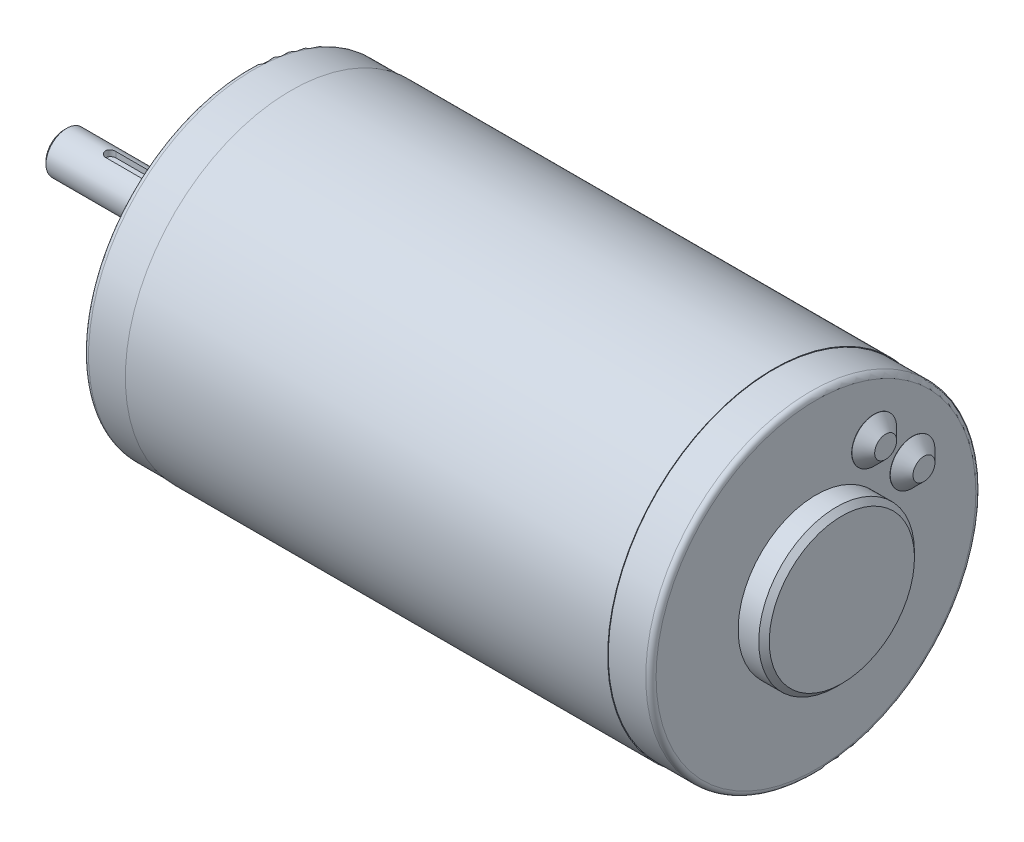
ISO-10303-21;
HEADER;
FILE_DESCRIPTION(('STEP AP214'),'2;1');
FILE_NAME('part.step','',(''),(''),'','','');
FILE_SCHEMA(('AUTOMOTIVE_DESIGN { 1 0 10303 214 1 1 1 1 }'));
ENDSEC;
DATA;
#1=APPLICATION_CONTEXT('core data for automotive mechanical design processes');
#2=APPLICATION_PROTOCOL_DEFINITION('international standard','automotive_design',2000,#1);
#3=PRODUCT_CONTEXT('',#1,'mechanical');
#4=PRODUCT('Part','Part','',(#3));
#5=PRODUCT_RELATED_PRODUCT_CATEGORY('part','',(#4));
#6=PRODUCT_DEFINITION_FORMATION('','',#4);
#7=PRODUCT_DEFINITION_CONTEXT('part definition',#1,'design');
#8=PRODUCT_DEFINITION('design','',#6,#7);
#9=PRODUCT_DEFINITION_SHAPE('','',#8);
#10=(LENGTH_UNIT() NAMED_UNIT(*) SI_UNIT(.MILLI.,.METRE.));
#11=(NAMED_UNIT(*) PLANE_ANGLE_UNIT() SI_UNIT($,.RADIAN.));
#12=(NAMED_UNIT(*) SI_UNIT($,.STERADIAN.) SOLID_ANGLE_UNIT());
#13=UNCERTAINTY_MEASURE_WITH_UNIT(LENGTH_MEASURE(1.E-05),#10,'distance_accuracy_value','');
#14=(GEOMETRIC_REPRESENTATION_CONTEXT(3) GLOBAL_UNCERTAINTY_ASSIGNED_CONTEXT((#13)) GLOBAL_UNIT_ASSIGNED_CONTEXT((#10,
#11,#12)) REPRESENTATION_CONTEXT('',''));
#15=CARTESIAN_POINT('',(0.,0.,0.));
#16=DIRECTION('',(0.,0.,1.));
#17=DIRECTION('',(1.,0.,0.));
#18=AXIS2_PLACEMENT_3D('',#15,#16,#17);
#19=CARTESIAN_POINT('',(-27.6,2.79999999999999,-1.));
#20=DIRECTION('',(0.,-1.,0.));
#21=DIRECTION('',(0.,0.,-1.));
#22=AXIS2_PLACEMENT_3D('',#19,#20,#21);
#23=PLANE('',#22);
#24=CARTESIAN_POINT('',(-7.1,2.79999999999999,0.));
#25=DIRECTION('',(0.,1.,0.));
#26=DIRECTION('',(0.,0.,1.));
#27=AXIS2_PLACEMENT_3D('',#24,#25,#26);
#28=CIRCLE('',#27,1.);
#29=CARTESIAN_POINT('',(-7.1,2.79999999999999,1.));
#30=VERTEX_POINT('',#29);
#31=CARTESIAN_POINT('',(-7.1,2.79999999999999,-1.));
#32=VERTEX_POINT('',#31);
#33=EDGE_CURVE('E80',#30,#32,#28,.T.);
#34=ORIENTED_EDGE('',*,*,#33,.T.);
#35=DIRECTION('',(1.,0.,0.));
#36=VECTOR('',#35,1.);
#37=CARTESIAN_POINT('',(-27.6,2.79999999999999,-1.));
#38=LINE('',#37,#36);
#39=CARTESIAN_POINT('',(-26.6,2.79999999999999,-1.));
#40=VERTEX_POINT('',#39);
#41=EDGE_CURVE('E75',#40,#32,#38,.T.);
#42=ORIENTED_EDGE('',*,*,#41,.F.);
#43=CARTESIAN_POINT('',(-26.6,2.79999999999999,0.));
#44=DIRECTION('',(0.,-1.,0.));
#45=DIRECTION('',(0.,0.,-1.));
#46=AXIS2_PLACEMENT_3D('',#43,#44,#45);
#47=CIRCLE('',#46,1.);
#48=CARTESIAN_POINT('',(-26.6,2.79999999999999,1.));
#49=VERTEX_POINT('',#48);
#50=EDGE_CURVE('E77',#40,#49,#47,.F.);
#51=ORIENTED_EDGE('',*,*,#50,.T.);
#52=DIRECTION('',(1.,0.,0.));
#53=VECTOR('',#52,1.);
#54=CARTESIAN_POINT('',(-27.6,2.79999999999999,1.));
#55=LINE('',#54,#53);
#56=EDGE_CURVE('E103',#49,#30,#55,.T.);
#57=ORIENTED_EDGE('',*,*,#56,.T.);
#58=EDGE_LOOP('',(#34,#42,#51,#57));
#59=FACE_BOUND('',#58,.T.);
#60=ADVANCED_FACE('F17',(#59),#23,.F.);
#61=CARTESIAN_POINT('',(-35.6,0.,0.));
#62=DIRECTION('',(-1.,0.,0.));
#63=DIRECTION('',(0.,0.,1.));
#64=AXIS2_PLACEMENT_3D('',#61,#62,#63);
#65=PLANE('',#64);
#66=CARTESIAN_POINT('',(-35.6000000000449,0.,0.));
#67=DIRECTION('',(1.,0.,0.));
#68=DIRECTION('',(0.,0.,-1.));
#69=AXIS2_PLACEMENT_3D('',#66,#67,#68);
#70=CIRCLE('',#69,3.49999999997408);
#71=CARTESIAN_POINT('',(-35.6000000000449,0.,-3.49999999997408));
#72=VERTEX_POINT('',#71);
#73=EDGE_CURVE('E325',#72,#72,#70,.T.);
#74=ORIENTED_EDGE('',*,*,#73,.F.);
#75=EDGE_LOOP('',(#74));
#76=FACE_BOUND('',#75,.T.);
#77=ADVANCED_FACE('F663',(#76),#65,.T.);
#78=CARTESIAN_POINT('',(-26.6,3.87298334620741,0.));
#79=DIRECTION('',(0.,-1.,0.));
#80=DIRECTION('',(0.,0.,-1.));
#81=AXIS2_PLACEMENT_3D('',#78,#79,#80);
#82=CYLINDRICAL_SURFACE('',#81,1.);
#83=CARTESIAN_POINT('',(-26.6,3.87298334620741,1.));
#84=CARTESIAN_POINT('',(-26.6276629851065,3.87298148580177,1.00000033749611));
#85=CARTESIAN_POINT('',(-26.6553122630182,3.8732800994947,0.998851407375366));
#86=CARTESIAN_POINT('',(-26.7104040353036,3.87445904774558,0.994271295395754));
#87=CARTESIAN_POINT('',(-26.7378465636871,3.87533928441687,0.99084049757268));
#88=CARTESIAN_POINT('',(-26.8194531732088,3.87881710972053,0.977175239382527));
#89=CARTESIAN_POINT('',(-26.8730564684822,3.88225203148808,0.963567695172493));
#90=CARTESIAN_POINT('',(-26.977124673782,3.89095422588002,0.927798076247996));
#91=CARTESIAN_POINT('',(-27.0275898782129,3.89622132630929,0.905636805423835));
#92=CARTESIAN_POINT('',(-27.1241114486473,3.90799134471939,0.853415378025865));
#93=CARTESIAN_POINT('',(-27.170166627891,3.91449459395647,0.823353103356933));
#94=CARTESIAN_POINT('',(-27.2575438819061,3.92816262398025,0.755484471828068));
#95=CARTESIAN_POINT('',(-27.2987548862455,3.93533791028915,0.717537268783974));
#96=CARTESIAN_POINT('',(-27.3743020894827,3.94945104396193,0.635275780516228));
#97=CARTESIAN_POINT('',(-27.4086371894679,3.95638885322537,0.590960479478829));
#98=CARTESIAN_POINT('',(-27.4699110016186,3.96936182283248,0.496456899401689));
#99=CARTESIAN_POINT('',(-27.496739895984,3.9753830468173,0.446195340334472));
#100=CARTESIAN_POINT('',(-27.5415247341967,3.98572346250588,0.341702590842916));
#101=CARTESIAN_POINT('',(-27.5594824242998,3.990042989147,0.287472184083007));
#102=CARTESIAN_POINT('',(-27.5856589927774,3.99641900005128,0.177744108525158));
#103=CARTESIAN_POINT('',(-27.5940676724228,3.998519529013,0.122294322002856));
#104=CARTESIAN_POINT('',(-27.6015033715433,4.00037438150815,0.0107327756816783));
#105=CARTESIAN_POINT('',(-27.6005315701923,4.00012899993444,-0.0453789000287066));
#106=CARTESIAN_POINT('',(-27.5893700363145,3.99735237365735,-0.155352492972097));
#107=CARTESIAN_POINT('',(-27.5793853834005,3.9948719867736,-0.209236701739855));
#108=CARTESIAN_POINT('',(-27.5508113208172,3.98796330636495,-0.31453871108434));
#109=CARTESIAN_POINT('',(-27.5322215304314,3.98353492665556,-0.365956402423988));
#110=CARTESIAN_POINT('',(-27.4867987193293,3.97314997761798,-0.46540728602454));
#111=CARTESIAN_POINT('',(-27.4598926057672,3.96717993827555,-0.513405629602248));
#112=CARTESIAN_POINT('',(-27.3986568701665,3.95435945541919,-0.604276631230015));
#113=CARTESIAN_POINT('',(-27.3643261297468,3.94750887933198,-0.64714851556229));
#114=CARTESIAN_POINT('',(-27.2881210879187,3.93345566022865,-0.727769389708492));
#115=CARTESIAN_POINT('',(-27.2460683634602,3.92624850477685,-0.765349103054128));
#116=CARTESIAN_POINT('',(-27.1561701330723,3.91246168284006,-0.832969575186237));
#117=CARTESIAN_POINT('',(-27.1083230467164,3.90588218842993,-0.863008270245062));
#118=CARTESIAN_POINT('',(-27.0078544021762,3.89407813586325,-0.914804709285962));
#119=CARTESIAN_POINT('',(-26.9552085351039,3.88886106009136,-0.936517017887269));
#120=CARTESIAN_POINT('',(-26.8468830715817,3.88047058807055,-0.970702351849828));
#121=CARTESIAN_POINT('',(-26.7912081448502,3.87729413761435,-0.983189189212132));
#122=CARTESIAN_POINT('',(-26.7125426192411,3.87455290681524,-0.993904635150938));
#123=CARTESIAN_POINT('',(-26.6900802967868,3.87396523110859,-0.996190790966708));
#124=CARTESIAN_POINT('',(-26.6450822100907,3.87318062488974,-0.999236757697394));
#125=CARTESIAN_POINT('',(-26.6225466240447,3.87298306219461,-0.999999038096045));
#126=CARTESIAN_POINT('',(-26.6,3.87298334620741,-1.));
#127=B_SPLINE_CURVE_WITH_KNOTS('',3,(#83,#84,#85,#86,#87,#88,#89,#90,#91,#92,#93,#94,#95,#96,
#97,#98,#99,#100,#101,#102,#103,#104,#105,#106,#107,#108,#109,#110,#111,#112,#113,#114,#115,
#116,#117,#118,#119,#120,#121,#122,#123,#124,#125,#126),.UNSPECIFIED.,.F.,.F.,(4,2,2,2,2,2,2,2,
2,2,2,2,2,2,2,2,2,2,2,2,2,4),(0.,0.0829365303397693,0.16585910608465,0.331229963080318,
0.496585282091499,0.661984974726751,0.830641897427977,0.999325753539196,1.17036187098235,
1.34136430732425,1.50890481515325,1.67642426256639,1.84022545479276,2.00403389475838,
2.16932509450376,2.33464120964329,2.50441429534542,2.67423379180967,2.84496720161068,
3.01544447539986,3.08315848722648,3.15076267731671),.UNSPECIFIED.);
#128=CARTESIAN_POINT('',(-26.6,3.87298334620741,1.));
#129=VERTEX_POINT('',#128);
#130=CARTESIAN_POINT('',(-26.6,3.87298334620741,-1.));
#131=VERTEX_POINT('',#130);
#132=EDGE_CURVE('E161',#129,#131,#127,.T.);
#133=ORIENTED_EDGE('',*,*,#132,.F.);
#134=DIRECTION('',(0.,1.,0.));
#135=VECTOR('',#134,1.);
#136=CARTESIAN_POINT('',(-26.6,2.79999999999999,1.));
#137=LINE('',#136,#135);
#138=EDGE_CURVE('E90',#129,#49,#137,.F.);
#139=ORIENTED_EDGE('',*,*,#138,.T.);
#140=ORIENTED_EDGE('',*,*,#50,.F.);
#141=DIRECTION('',(0.,1.,0.));
#142=VECTOR('',#141,1.);
#143=CARTESIAN_POINT('',(-26.6,2.79999999999999,-1.));
#144=LINE('',#143,#142);
#145=EDGE_CURVE('E84',#131,#40,#144,.F.);
#146=ORIENTED_EDGE('',*,*,#145,.F.);
#147=EDGE_LOOP('',(#133,#139,#140,#146));
#148=FACE_BOUND('',#147,.T.);
#149=ADVANCED_FACE('F87',(#148),#82,.F.);
#150=CARTESIAN_POINT('',(-27.6,2.79999999999999,-1.));
#151=DIRECTION('',(0.,0.,1.));
#152=DIRECTION('',(1.,0.,0.));
#153=AXIS2_PLACEMENT_3D('',#150,#151,#152);
#154=PLANE('',#153);
#155=DIRECTION('',(1.,0.,0.));
#156=VECTOR('',#155,1.);
#157=CARTESIAN_POINT('',(0.,3.87298334620741,-1.));
#158=LINE('',#157,#156);
#159=CARTESIAN_POINT('',(-7.1,3.87298334620741,-1.));
#160=VERTEX_POINT('',#159);
#161=EDGE_CURVE('E95',#131,#160,#158,.T.);
#162=ORIENTED_EDGE('',*,*,#161,.F.);
#163=ORIENTED_EDGE('',*,*,#145,.T.);
#164=ORIENTED_EDGE('',*,*,#41,.T.);
#165=DIRECTION('',(0.,1.,0.));
#166=VECTOR('',#165,1.);
#167=CARTESIAN_POINT('',(-7.1,2.79999999999999,-1.));
#168=LINE('',#167,#166);
#169=EDGE_CURVE('E98',#32,#160,#168,.T.);
#170=ORIENTED_EDGE('',*,*,#169,.T.);
#171=EDGE_LOOP('',(#162,#163,#164,#170));
#172=FACE_BOUND('',#171,.T.);
#173=ADVANCED_FACE('F93',(#172),#154,.T.);
#174=CARTESIAN_POINT('',(-7.1,2.79999999999999,0.));
#175=DIRECTION('',(0.,1.,0.));
#176=DIRECTION('',(0.,0.,1.));
#177=AXIS2_PLACEMENT_3D('',#174,#175,#176);
#178=CYLINDRICAL_SURFACE('',#177,1.);
#179=ORIENTED_EDGE('',*,*,#33,.F.);
#180=DIRECTION('',(0.,1.,0.));
#181=VECTOR('',#180,1.);
#182=CARTESIAN_POINT('',(-7.1,2.79999999999999,1.));
#183=LINE('',#182,#181);
#184=CARTESIAN_POINT('',(-7.1,3.87298334620741,1.));
#185=VERTEX_POINT('',#184);
#186=EDGE_CURVE('E104',#30,#185,#183,.T.);
#187=ORIENTED_EDGE('',*,*,#186,.T.);
#188=CARTESIAN_POINT('',(-7.1,3.87298334620741,-1.));
#189=CARTESIAN_POINT('',(-7.07233701489346,3.87298148580177,-1.00000033749611));
#190=CARTESIAN_POINT('',(-7.04468773698177,3.8732800994947,-0.998851407375366));
#191=CARTESIAN_POINT('',(-6.98959596469644,3.87445904774558,-0.994271295395754));
#192=CARTESIAN_POINT('',(-6.96215343631291,3.87533928441687,-0.990840497572679));
#193=CARTESIAN_POINT('',(-6.88054682679116,3.87881710972053,-0.977175239382527));
#194=CARTESIAN_POINT('',(-6.82694353151779,3.88225203148808,-0.963567695172494));
#195=CARTESIAN_POINT('',(-6.72287532621804,3.89095422588002,-0.927798076247997));
#196=CARTESIAN_POINT('',(-6.67241012178715,3.89622132630929,-0.905636805423836));
#197=CARTESIAN_POINT('',(-6.57588855135267,3.90799134471939,-0.853415378025865));
#198=CARTESIAN_POINT('',(-6.52983337210904,3.91449459395647,-0.823353103356933));
#199=CARTESIAN_POINT('',(-6.4424561180939,3.92816262398025,-0.755484471828069));
#200=CARTESIAN_POINT('',(-6.40124511375448,3.93533791028915,-0.717537268783976));
#201=CARTESIAN_POINT('',(-6.3256979105173,3.94945104396193,-0.63527578051623));
#202=CARTESIAN_POINT('',(-6.29136281053206,3.95638885322537,-0.590960479478831));
#203=CARTESIAN_POINT('',(-6.23008899838136,3.96936182283248,-0.496456899401691));
#204=CARTESIAN_POINT('',(-6.20326010401603,3.9753830468173,-0.446195340334474));
#205=CARTESIAN_POINT('',(-6.1584752658033,3.98572346250588,-0.341702590842919));
#206=CARTESIAN_POINT('',(-6.14051757570017,3.990042989147,-0.28747218408301));
#207=CARTESIAN_POINT('',(-6.11434100722257,3.99641900005128,-0.17774410852516));
#208=CARTESIAN_POINT('',(-6.10593232757718,3.998519529013,-0.122294322002858));
#209=CARTESIAN_POINT('',(-6.09849662845671,4.00037438150815,-0.0107327756816796));
#210=CARTESIAN_POINT('',(-6.09946842980766,4.00012899993444,0.0453789000287056));
#211=CARTESIAN_POINT('',(-6.11062996368545,3.99735237365735,0.155352492972096));
#212=CARTESIAN_POINT('',(-6.12061461659948,3.9948719867736,0.209236701739855));
#213=CARTESIAN_POINT('',(-6.14918867918275,3.98796330636495,0.31453871108434));
#214=CARTESIAN_POINT('',(-6.16777846956858,3.98353492665556,0.365956402423988));
#215=CARTESIAN_POINT('',(-6.21320128067065,3.97314997761798,0.465407286024539));
#216=CARTESIAN_POINT('',(-6.24010739423284,3.96717993827555,0.513405629602249));
#217=CARTESIAN_POINT('',(-6.30134312983347,3.95435945541919,0.604276631230014));
#218=CARTESIAN_POINT('',(-6.33567387025322,3.94750887933198,0.647148515562289));
#219=CARTESIAN_POINT('',(-6.41187891208131,3.93345566022865,0.72776938970849));
#220=CARTESIAN_POINT('',(-6.45393163653982,3.92624850477685,0.765349103054127));
#221=CARTESIAN_POINT('',(-6.54382986692774,3.91246168284006,0.832969575186237));
#222=CARTESIAN_POINT('',(-6.59167695328356,3.90588218842993,0.863008270245062));
#223=CARTESIAN_POINT('',(-6.69214559782377,3.89407813586325,0.914804709285962));
#224=CARTESIAN_POINT('',(-6.74479146489609,3.88886106009136,0.936517017887269));
#225=CARTESIAN_POINT('',(-6.85311692841829,3.88047058807055,0.970702351849828));
#226=CARTESIAN_POINT('',(-6.90879185514984,3.87729413761435,0.983189189212131));
#227=CARTESIAN_POINT('',(-6.98745738075891,3.87455290681524,0.993904635150938));
#228=CARTESIAN_POINT('',(-7.00991970321318,3.87396523110859,0.996190790966708));
#229=CARTESIAN_POINT('',(-7.05491778990932,3.87318062488974,0.999236757697394));
#230=CARTESIAN_POINT('',(-7.07745337595529,3.8729830621946,0.999999038096045));
#231=CARTESIAN_POINT('',(-7.1,3.87298334620741,1.));
#232=B_SPLINE_CURVE_WITH_KNOTS('',3,(#188,#189,#190,#191,#192,#193,#194,#195,#196,#197,#198,
#199,#200,#201,#202,#203,#204,#205,#206,#207,#208,#209,#210,#211,#212,#213,#214,#215,#216,#217,
#218,#219,#220,#221,#222,#223,#224,#225,#226,#227,#228,#229,#230,#231),.UNSPECIFIED.,.F.,.F.,(4,
2,2,2,2,2,2,2,2,2,2,2,2,2,2,2,2,2,2,2,2,4),(0.,0.0829365303397684,0.165859106084651,
0.331229963080317,0.496585282091498,0.661984974726749,0.830641897427974,0.999325753539193,
1.17036187098235,1.34136430732424,1.50890481515325,1.67642426256639,1.84022545479276,
2.00403389475838,2.16932509450376,2.33464120964329,2.50441429534542,2.67423379180967,
2.84496720161068,3.01544447539986,3.08315848722648,3.15076267731671),.UNSPECIFIED.);
#233=EDGE_CURVE('E152',#160,#185,#232,.T.);
#234=ORIENTED_EDGE('',*,*,#233,.F.);
#235=ORIENTED_EDGE('',*,*,#169,.F.);
#236=EDGE_LOOP('',(#179,#187,#234,#235));
#237=FACE_BOUND('',#236,.T.);
#238=ADVANCED_FACE('F167',(#237),#178,.F.);
#239=CARTESIAN_POINT('',(-27.6,2.79999999999999,1.));
#240=DIRECTION('',(0.,0.,1.));
#241=DIRECTION('',(1.,0.,0.));
#242=AXIS2_PLACEMENT_3D('',#239,#240,#241);
#243=PLANE('',#242);
#244=ORIENTED_EDGE('',*,*,#186,.F.);
#245=ORIENTED_EDGE('',*,*,#56,.F.);
#246=ORIENTED_EDGE('',*,*,#138,.F.);
#247=DIRECTION('',(1.,0.,0.));
#248=VECTOR('',#247,1.);
#249=CARTESIAN_POINT('',(0.,3.87298334620741,1.));
#250=LINE('',#249,#248);
#251=EDGE_CURVE('E160',#185,#129,#250,.F.);
#252=ORIENTED_EDGE('',*,*,#251,.F.);
#253=EDGE_LOOP('',(#244,#245,#246,#252));
#254=FACE_BOUND('',#253,.T.);
#255=ADVANCED_FACE('F182',(#254),#243,.F.);
#256=CARTESIAN_POINT('',(-35.0999999999999,0.,0.));
#257=DIRECTION('',(1.,0.,0.));
#258=DIRECTION('',(0.,0.,-1.));
#259=AXIS2_PLACEMENT_3D('',#256,#257,#258);
#260=CONICAL_SURFACE('',#259,3.99999999996226,0.785398163340605);
#261=ORIENTED_EDGE('',*,*,#73,.T.);
#262=EDGE_LOOP('',(#261));
#263=FACE_BOUND('',#262,.T.);
#264=CARTESIAN_POINT('',(-35.1,0.,0.));
#265=DIRECTION('',(1.,0.,0.));
#266=DIRECTION('',(0.,0.,-1.));
#267=AXIS2_PLACEMENT_3D('',#264,#265,#266);
#268=CIRCLE('',#267,4.);
#269=CARTESIAN_POINT('',(-35.1,0.,-4.));
#270=VERTEX_POINT('',#269);
#271=EDGE_CURVE('E151',#270,#270,#268,.T.);
#272=ORIENTED_EDGE('',*,*,#271,.F.);
#273=EDGE_LOOP('',(#272));
#274=FACE_BOUND('',#273,.T.);
#275=ADVANCED_FACE('F177',(#263,#274),#260,.T.);
#276=CARTESIAN_POINT('',(0.,0.,0.));
#277=DIRECTION('',(1.,0.,0.));
#278=DIRECTION('',(0.,0.,-1.));
#279=AXIS2_PLACEMENT_3D('',#276,#277,#278);
#280=CYLINDRICAL_SURFACE('',#279,4.);
#281=ORIENTED_EDGE('',*,*,#271,.T.);
#282=EDGE_LOOP('',(#281));
#283=FACE_BOUND('',#282,.T.);
#284=CARTESIAN_POINT('',(-4.,0.,0.));
#285=DIRECTION('',(1.,0.,0.));
#286=DIRECTION('',(0.,0.,-1.));
#287=AXIS2_PLACEMENT_3D('',#284,#285,#286);
#288=CIRCLE('',#287,4.);
#289=CARTESIAN_POINT('',(-4.,0.,-4.));
#290=VERTEX_POINT('',#289);
#291=EDGE_CURVE('E148',#290,#290,#288,.T.);
#292=ORIENTED_EDGE('',*,*,#291,.F.);
#293=EDGE_LOOP('',(#292));
#294=FACE_BOUND('',#293,.T.);
#295=ORIENTED_EDGE('',*,*,#233,.T.);
#296=ORIENTED_EDGE('',*,*,#251,.T.);
#297=ORIENTED_EDGE('',*,*,#132,.T.);
#298=ORIENTED_EDGE('',*,*,#161,.T.);
#299=EDGE_LOOP('',(#295,#296,#297,#298));
#300=FACE_BOUND('',#299,.T.);
#301=ADVANCED_FACE('F171',(#283,#294,#300),#280,.T.);
#302=CARTESIAN_POINT('',(-4.,4.,0.));
#303=DIRECTION('',(-1.,0.,0.));
#304=DIRECTION('',(0.,0.,1.));
#305=AXIS2_PLACEMENT_3D('',#302,#303,#304);
#306=PLANE('',#305);
#307=ORIENTED_EDGE('',*,*,#291,.T.);
#308=EDGE_LOOP('',(#307));
#309=FACE_BOUND('',#308,.T.);
#310=CARTESIAN_POINT('',(-4.,0.,0.));
#311=DIRECTION('',(1.,0.,0.));
#312=DIRECTION('',(0.,1.,0.));
#313=AXIS2_PLACEMENT_3D('',#310,#311,#312);
#314=CIRCLE('',#313,8.509);
#315=CARTESIAN_POINT('',(-4.,8.509,0.));
#316=VERTEX_POINT('',#315);
#317=EDGE_CURVE('E145',#316,#316,#314,.T.);
#318=ORIENTED_EDGE('',*,*,#317,.F.);
#319=EDGE_LOOP('',(#318));
#320=FACE_BOUND('',#319,.T.);
#321=ADVANCED_FACE('F176',(#309,#320),#306,.T.);
#322=CARTESIAN_POINT('',(111.8479,18.6070906828553,-11.2073596390943));
#323=DIRECTION('',(1.,0.,0.));
#324=DIRECTION('',(0.,0.,-1.));
#325=AXIS2_PLACEMENT_3D('',#322,#323,#324);
#326=PLANE('',#325);
#327=CARTESIAN_POINT('',(111.84789999993,18.6070906828553,-11.2073596390943));
#328=DIRECTION('',(-1.,0.,0.));
#329=DIRECTION('',(0.,-1.,0.));
#330=AXIS2_PLACEMENT_3D('',#327,#328,#329);
#331=CIRCLE('',#330,2.11800000003146);
#332=CARTESIAN_POINT('',(111.84789999993,16.4890906828238,-11.2073596390943));
#333=VERTEX_POINT('',#332);
#334=EDGE_CURVE('E142',#333,#333,#331,.T.);
#335=ORIENTED_EDGE('',*,*,#334,.F.);
#336=EDGE_LOOP('',(#335));
#337=FACE_BOUND('',#336,.T.);
#338=ADVANCED_FACE('F465',(#337),#326,.T.);
#339=CARTESIAN_POINT('',(114.6,15.0368,0.));
#340=DIRECTION('',(1.,0.,0.));
#341=DIRECTION('',(0.,0.,-1.));
#342=AXIS2_PLACEMENT_3D('',#339,#340,#341);
#343=PLANE('',#342);
#344=CARTESIAN_POINT('',(114.6,0.,0.));
#345=DIRECTION('',(-1.,0.,0.));
#346=DIRECTION('',(0.,-1.,0.));
#347=AXIS2_PLACEMENT_3D('',#344,#345,#346);
#348=CIRCLE('',#347,14.0208);
#349=CARTESIAN_POINT('',(114.6,-14.0208,0.));
#350=VERTEX_POINT('',#349);
#351=EDGE_CURVE('E139',#350,#350,#348,.T.);
#352=ORIENTED_EDGE('',*,*,#351,.F.);
#353=EDGE_LOOP('',(#352));
#354=FACE_BOUND('',#353,.T.);
#355=ADVANCED_FACE('F455',(#354),#343,.T.);
#356=CARTESIAN_POINT('',(111.8479,11.2073596390943,-18.6070906828553));
#357=DIRECTION('',(1.,0.,0.));
#358=DIRECTION('',(0.,0.,-1.));
#359=AXIS2_PLACEMENT_3D('',#356,#357,#358);
#360=PLANE('',#359);
#361=CARTESIAN_POINT('',(111.84789999993,11.2073596390943,-18.6070906828553));
#362=DIRECTION('',(-1.,0.,0.));
#363=DIRECTION('',(0.,0.,1.));
#364=AXIS2_PLACEMENT_3D('',#361,#362,#363);
#365=CIRCLE('',#364,2.1180000000021);
#366=CARTESIAN_POINT('',(111.84789999993,11.2073596390943,-16.4890906828532));
#367=VERTEX_POINT('',#366);
#368=EDGE_CURVE('E135',#367,#367,#365,.T.);
#369=ORIENTED_EDGE('',*,*,#368,.F.);
#370=EDGE_LOOP('',(#369));
#371=FACE_BOUND('',#370,.T.);
#372=ADVANCED_FACE('F448',(#371),#360,.T.);
#373=CARTESIAN_POINT('',(13.6143999999945,25.4,0.));
#374=DIRECTION('',(-1.,0.,0.));
#375=DIRECTION('',(0.,0.,1.));
#376=AXIS2_PLACEMENT_3D('',#373,#374,#375);
#377=CONICAL_SURFACE('',#376,2.01929999997219,1.02974425867198);
#378=CARTESIAN_POINT('',(14.827717847993,25.4,0.));
#379=VERTEX_POINT('',#378);
#380=VERTEX_LOOP('',#379);
#381=FACE_BOUND('',#380,.T.);
#382=CARTESIAN_POINT('',(13.6144,25.4,0.));
#383=DIRECTION('',(-1.,0.,0.));
#384=DIRECTION('',(0.,0.,1.));
#385=AXIS2_PLACEMENT_3D('',#382,#383,#384);
#386=CIRCLE('',#385,2.0193);
#387=CARTESIAN_POINT('',(13.6144,25.4,2.0193));
#388=VERTEX_POINT('',#387);
#389=EDGE_CURVE('E138',#388,#388,#386,.T.);
#390=ORIENTED_EDGE('',*,*,#389,.T.);
#391=EDGE_LOOP('',(#390));
#392=FACE_BOUND('',#391,.T.);
#393=ADVANCED_FACE('F454',(#381,#392),#377,.F.);
#394=CARTESIAN_POINT('',(13.6143999999945,-25.4,0.));
#395=DIRECTION('',(-1.,0.,0.));
#396=DIRECTION('',(0.,0.,1.));
#397=AXIS2_PLACEMENT_3D('',#394,#395,#396);
#398=CONICAL_SURFACE('',#397,2.01929999997219,1.02974425867198);
#399=CARTESIAN_POINT('',(14.827717847993,-25.4,0.));
#400=VERTEX_POINT('',#399);
#401=VERTEX_LOOP('',#400);
#402=FACE_BOUND('',#401,.T.);
#403=CARTESIAN_POINT('',(13.6144,-25.4,0.));
#404=DIRECTION('',(-1.,0.,0.));
#405=DIRECTION('',(0.,0.,1.));
#406=AXIS2_PLACEMENT_3D('',#403,#404,#405);
#407=CIRCLE('',#406,2.0193);
#408=CARTESIAN_POINT('',(13.6144,-25.4,2.0193));
#409=VERTEX_POINT('',#408);
#410=EDGE_CURVE('E315',#409,#409,#407,.T.);
#411=ORIENTED_EDGE('',*,*,#410,.T.);
#412=EDGE_LOOP('',(#411));
#413=FACE_BOUND('',#412,.T.);
#414=ADVANCED_FACE('F516',(#402,#413),#398,.F.);
#415=CARTESIAN_POINT('',(-2.984,0.,0.));
#416=DIRECTION('',(1.,0.,0.));
#417=DIRECTION('',(0.,1.,0.));
#418=AXIS2_PLACEMENT_3D('',#415,#416,#417);
#419=CONICAL_SURFACE('',#418,9.525,0.78539816339745);
#420=ORIENTED_EDGE('',*,*,#317,.T.);
#421=EDGE_LOOP('',(#420));
#422=FACE_BOUND('',#421,.T.);
#423=CARTESIAN_POINT('',(-2.984,0.,0.));
#424=DIRECTION('',(1.,0.,0.));
#425=DIRECTION('',(0.,0.,-1.));
#426=AXIS2_PLACEMENT_3D('',#423,#424,#425);
#427=CIRCLE('',#426,9.525);
#428=CARTESIAN_POINT('',(-2.984,0.,-9.525));
#429=VERTEX_POINT('',#428);
#430=EDGE_CURVE('E312',#429,#429,#427,.T.);
#431=ORIENTED_EDGE('',*,*,#430,.F.);
#432=EDGE_LOOP('',(#431));
#433=FACE_BOUND('',#432,.T.);
#434=ADVANCED_FACE('F440',(#422,#433),#419,.T.);
#435=CARTESIAN_POINT('',(109.647900000027,18.6070906828553,-11.2073596390943));
#436=DIRECTION('',(-1.,0.,0.));
#437=DIRECTION('',(0.,-1.,0.));
#438=AXIS2_PLACEMENT_3D('',#435,#436,#437);
#439=CONICAL_SURFACE('',#438,4.31799999987712,0.785398163384529);
#440=CARTESIAN_POINT('',(109.6479,18.6070906828553,-11.2073596390943));
#441=DIRECTION('',(-1.,0.,0.));
#442=DIRECTION('',(0.,0.,1.));
#443=AXIS2_PLACEMENT_3D('',#440,#441,#442);
#444=CIRCLE('',#443,4.318);
#445=CARTESIAN_POINT('',(109.6479,18.6070906828553,-6.88935963909434));
#446=VERTEX_POINT('',#445);
#447=EDGE_CURVE('E309',#446,#446,#444,.T.);
#448=ORIENTED_EDGE('',*,*,#447,.F.);
#449=EDGE_LOOP('',(#448));
#450=FACE_BOUND('',#449,.T.);
#451=ORIENTED_EDGE('',*,*,#334,.T.);
#452=EDGE_LOOP('',(#451));
#453=FACE_BOUND('',#452,.T.);
#454=ADVANCED_FACE('F434',(#450,#453),#439,.T.);
#455=CARTESIAN_POINT('',(113.584,0.,0.));
#456=DIRECTION('',(-1.,0.,0.));
#457=DIRECTION('',(0.,-1.,0.));
#458=AXIS2_PLACEMENT_3D('',#455,#456,#457);
#459=CONICAL_SURFACE('',#458,15.0368,0.785398163397441);
#460=ORIENTED_EDGE('',*,*,#351,.T.);
#461=EDGE_LOOP('',(#460));
#462=FACE_BOUND('',#461,.T.);
#463=CARTESIAN_POINT('',(113.584,0.,0.));
#464=DIRECTION('',(1.,0.,0.));
#465=DIRECTION('',(0.,0.,-1.));
#466=AXIS2_PLACEMENT_3D('',#463,#464,#465);
#467=CIRCLE('',#466,15.0368);
#468=CARTESIAN_POINT('',(113.584,0.,-15.0368));
#469=VERTEX_POINT('',#468);
#470=EDGE_CURVE('E306',#469,#469,#467,.F.);
#471=ORIENTED_EDGE('',*,*,#470,.F.);
#472=EDGE_LOOP('',(#471));
#473=FACE_BOUND('',#472,.T.);
#474=ADVANCED_FACE('F424',(#462,#473),#459,.T.);
#475=CARTESIAN_POINT('',(109.647900000084,11.2073596390943,-18.6070906828553));
#476=DIRECTION('',(-1.,0.,0.));
#477=DIRECTION('',(0.,0.,1.));
#478=AXIS2_PLACEMENT_3D('',#475,#476,#477);
#479=CONICAL_SURFACE('',#478,4.31799999990461,0.785398163410367);
#480=CARTESIAN_POINT('',(109.6479,11.2073596390943,-18.6070906828553));
#481=DIRECTION('',(-1.,0.,0.));
#482=DIRECTION('',(0.,0.,1.));
#483=AXIS2_PLACEMENT_3D('',#480,#481,#482);
#484=CIRCLE('',#483,4.318);
#485=CARTESIAN_POINT('',(109.6479,11.2073596390943,-14.2890906828553));
#486=VERTEX_POINT('',#485);
#487=EDGE_CURVE('E134',#486,#486,#484,.T.);
#488=ORIENTED_EDGE('',*,*,#487,.F.);
#489=EDGE_LOOP('',(#488));
#490=FACE_BOUND('',#489,.T.);
#491=ORIENTED_EDGE('',*,*,#368,.T.);
#492=EDGE_LOOP('',(#491));
#493=FACE_BOUND('',#492,.T.);
#494=ADVANCED_FACE('F417',(#490,#493),#479,.T.);
#495=CARTESIAN_POINT('',(0.,25.4,0.));
#496=DIRECTION('',(-1.,0.,0.));
#497=DIRECTION('',(0.,0.,1.));
#498=AXIS2_PLACEMENT_3D('',#495,#496,#497);
#499=CYLINDRICAL_SURFACE('',#498,2.0193);
#500=CARTESIAN_POINT('',(0.,25.4,0.));
#501=DIRECTION('',(-1.,0.,0.));
#502=DIRECTION('',(0.,0.,1.));
#503=AXIS2_PLACEMENT_3D('',#500,#501,#502);
#504=CIRCLE('',#503,2.0193);
#505=CARTESIAN_POINT('',(0.,25.4,2.0193));
#506=VERTEX_POINT('',#505);
#507=EDGE_CURVE('E131',#506,#506,#504,.F.);
#508=ORIENTED_EDGE('',*,*,#507,.F.);
#509=EDGE_LOOP('',(#508));
#510=FACE_BOUND('',#509,.T.);
#511=ORIENTED_EDGE('',*,*,#389,.F.);
#512=EDGE_LOOP('',(#511));
#513=FACE_BOUND('',#512,.T.);
#514=ADVANCED_FACE('F423',(#510,#513),#499,.F.);
#515=CARTESIAN_POINT('',(0.,-25.4,0.));
#516=DIRECTION('',(-1.,0.,0.));
#517=DIRECTION('',(0.,0.,1.));
#518=AXIS2_PLACEMENT_3D('',#515,#516,#517);
#519=CYLINDRICAL_SURFACE('',#518,2.0193);
#520=CARTESIAN_POINT('',(0.,-25.4,0.));
#521=DIRECTION('',(-1.,0.,0.));
#522=DIRECTION('',(0.,0.,1.));
#523=AXIS2_PLACEMENT_3D('',#520,#521,#522);
#524=CIRCLE('',#523,2.0193);
#525=CARTESIAN_POINT('',(0.,-25.4,2.0193));
#526=VERTEX_POINT('',#525);
#527=EDGE_CURVE('E128',#526,#526,#524,.F.);
#528=ORIENTED_EDGE('',*,*,#527,.F.);
#529=EDGE_LOOP('',(#528));
#530=FACE_BOUND('',#529,.T.);
#531=ORIENTED_EDGE('',*,*,#410,.F.);
#532=EDGE_LOOP('',(#531));
#533=FACE_BOUND('',#532,.T.);
#534=ADVANCED_FACE('F541',(#530,#533),#519,.F.);
#535=CARTESIAN_POINT('',(0.,0.,0.));
#536=DIRECTION('',(1.,0.,0.));
#537=DIRECTION('',(0.,0.,-1.));
#538=AXIS2_PLACEMENT_3D('',#535,#536,#537);
#539=CYLINDRICAL_SURFACE('',#538,9.525);
#540=ORIENTED_EDGE('',*,*,#430,.T.);
#541=EDGE_LOOP('',(#540));
#542=FACE_BOUND('',#541,.T.);
#543=CARTESIAN_POINT('',(0.,0.,0.));
#544=DIRECTION('',(1.,0.,0.));
#545=DIRECTION('',(0.,0.,-1.));
#546=AXIS2_PLACEMENT_3D('',#543,#544,#545);
#547=CIRCLE('',#546,9.525);
#548=CARTESIAN_POINT('',(0.,0.,-9.525));
#549=VERTEX_POINT('',#548);
#550=EDGE_CURVE('E125',#549,#549,#547,.T.);
#551=ORIENTED_EDGE('',*,*,#550,.F.);
#552=EDGE_LOOP('',(#551));
#553=FACE_BOUND('',#552,.T.);
#554=ADVANCED_FACE('F409',(#542,#553),#539,.T.);
#555=CARTESIAN_POINT('',(111.8479,18.6070906828553,-11.2073596390943));
#556=DIRECTION('',(-1.,0.,0.));
#557=DIRECTION('',(0.,0.,1.));
#558=AXIS2_PLACEMENT_3D('',#555,#556,#557);
#559=CYLINDRICAL_SURFACE('',#558,4.318);
#560=CARTESIAN_POINT('',(109.6,18.6070906828553,-11.2073596390943));
#561=DIRECTION('',(-1.,0.,0.));
#562=DIRECTION('',(0.,0.,1.));
#563=AXIS2_PLACEMENT_3D('',#560,#561,#562);
#564=CIRCLE('',#563,4.318);
#565=CARTESIAN_POINT('',(109.6,18.6070906828553,-6.88935963909434));
#566=VERTEX_POINT('',#565);
#567=EDGE_CURVE('E122',#566,#566,#564,.T.);
#568=ORIENTED_EDGE('',*,*,#567,.F.);
#569=EDGE_LOOP('',(#568));
#570=FACE_BOUND('',#569,.T.);
#571=ORIENTED_EDGE('',*,*,#447,.T.);
#572=EDGE_LOOP('',(#571));
#573=FACE_BOUND('',#572,.T.);
#574=ADVANCED_FACE('F403',(#570,#573),#559,.T.);
#575=CARTESIAN_POINT('',(0.,0.,0.));
#576=DIRECTION('',(1.,0.,0.));
#577=DIRECTION('',(0.,0.,-1.));
#578=AXIS2_PLACEMENT_3D('',#575,#576,#577);
#579=CYLINDRICAL_SURFACE('',#578,15.0368);
#580=CARTESIAN_POINT('',(109.6,0.,0.));
#581=DIRECTION('',(1.,0.,0.));
#582=DIRECTION('',(0.,0.,-1.));
#583=AXIS2_PLACEMENT_3D('',#580,#581,#582);
#584=CIRCLE('',#583,15.0368);
#585=CARTESIAN_POINT('',(109.6,0.,-15.0368));
#586=VERTEX_POINT('',#585);
#587=EDGE_CURVE('E119',#586,#586,#584,.F.);
#588=ORIENTED_EDGE('',*,*,#587,.F.);
#589=EDGE_LOOP('',(#588));
#590=FACE_BOUND('',#589,.T.);
#591=ORIENTED_EDGE('',*,*,#470,.T.);
#592=EDGE_LOOP('',(#591));
#593=FACE_BOUND('',#592,.T.);
#594=ADVANCED_FACE('F394',(#590,#593),#579,.T.);
#595=CARTESIAN_POINT('',(111.8479,11.2073596390943,-18.6070906828553));
#596=DIRECTION('',(-1.,0.,0.));
#597=DIRECTION('',(0.,0.,1.));
#598=AXIS2_PLACEMENT_3D('',#595,#596,#597);
#599=CYLINDRICAL_SURFACE('',#598,4.318);
#600=CARTESIAN_POINT('',(109.6,11.2073596390943,-18.6070906828553));
#601=DIRECTION('',(-1.,0.,0.));
#602=DIRECTION('',(0.,0.,1.));
#603=AXIS2_PLACEMENT_3D('',#600,#601,#602);
#604=CIRCLE('',#603,4.318);
#605=CARTESIAN_POINT('',(109.6,11.2073596390943,-14.2890906828553));
#606=VERTEX_POINT('',#605);
#607=EDGE_CURVE('E115',#606,#606,#604,.T.);
#608=ORIENTED_EDGE('',*,*,#607,.F.);
#609=EDGE_LOOP('',(#608));
#610=FACE_BOUND('',#609,.T.);
#611=ORIENTED_EDGE('',*,*,#487,.T.);
#612=EDGE_LOOP('',(#611));
#613=FACE_BOUND('',#612,.T.);
#614=ADVANCED_FACE('F388',(#610,#613),#599,.T.);
#615=CARTESIAN_POINT('',(0.,9.525,0.));
#616=DIRECTION('',(-1.,0.,0.));
#617=DIRECTION('',(0.,0.,1.));
#618=AXIS2_PLACEMENT_3D('',#615,#616,#617);
#619=PLANE('',#618);
#620=ORIENTED_EDGE('',*,*,#550,.T.);
#621=EDGE_LOOP('',(#620));
#622=FACE_BOUND('',#621,.T.);
#623=CARTESIAN_POINT('',(0.,0.,0.));
#624=DIRECTION('',(1.,0.,0.));
#625=DIRECTION('',(0.,0.,-1.));
#626=AXIS2_PLACEMENT_3D('',#623,#624,#625);
#627=CIRCLE('',#626,30.877);
#628=CARTESIAN_POINT('',(0.,0.,-30.877));
#629=VERTEX_POINT('',#628);
#630=CARTESIAN_POINT('',(0.,0.,30.877));
#631=VERTEX_POINT('',#630);
#632=EDGE_CURVE('E118',#629,#631,#627,.T.);
#633=ORIENTED_EDGE('',*,*,#632,.F.);
#634=CARTESIAN_POINT('',(0.,0.,0.));
#635=DIRECTION('',(1.,0.,0.));
#636=DIRECTION('',(0.,0.,1.));
#637=AXIS2_PLACEMENT_3D('',#634,#635,#636);
#638=CIRCLE('',#637,30.877);
#639=EDGE_CURVE('E285',#631,#629,#638,.T.);
#640=ORIENTED_EDGE('',*,*,#639,.F.);
#641=EDGE_LOOP('',(#633,#640));
#642=FACE_BOUND('',#641,.T.);
#643=ORIENTED_EDGE('',*,*,#527,.T.);
#644=EDGE_LOOP('',(#643));
#645=FACE_BOUND('',#644,.T.);
#646=ORIENTED_EDGE('',*,*,#507,.T.);
#647=EDGE_LOOP('',(#646));
#648=FACE_BOUND('',#647,.T.);
#649=ADVANCED_FACE('F251',(#622,#642,#645,#648),#619,.T.);
#650=CARTESIAN_POINT('',(109.6,31.877,0.));
#651=DIRECTION('',(1.,0.,0.));
#652=DIRECTION('',(0.,0.,-1.));
#653=AXIS2_PLACEMENT_3D('',#650,#651,#652);
#654=PLANE('',#653);
#655=ORIENTED_EDGE('',*,*,#607,.T.);
#656=EDGE_LOOP('',(#655));
#657=FACE_BOUND('',#656,.T.);
#658=ORIENTED_EDGE('',*,*,#587,.T.);
#659=EDGE_LOOP('',(#658));
#660=FACE_BOUND('',#659,.T.);
#661=CARTESIAN_POINT('',(109.6,0.,0.));
#662=DIRECTION('',(-1.,0.,0.));
#663=DIRECTION('',(0.,0.,1.));
#664=AXIS2_PLACEMENT_3D('',#661,#662,#663);
#665=CIRCLE('',#664,30.877);
#666=CARTESIAN_POINT('',(109.6,0.,30.877));
#667=VERTEX_POINT('',#666);
#668=CARTESIAN_POINT('',(109.6,0.,-30.877));
#669=VERTEX_POINT('',#668);
#670=EDGE_CURVE('E36',#667,#669,#665,.T.);
#671=ORIENTED_EDGE('',*,*,#670,.F.);
#672=CARTESIAN_POINT('',(109.6,0.,0.));
#673=DIRECTION('',(-1.,0.,0.));
#674=DIRECTION('',(0.,0.,-1.));
#675=AXIS2_PLACEMENT_3D('',#672,#673,#674);
#676=CIRCLE('',#675,30.877);
#677=EDGE_CURVE('E233',#669,#667,#676,.T.);
#678=ORIENTED_EDGE('',*,*,#677,.F.);
#679=EDGE_LOOP('',(#671,#678));
#680=FACE_BOUND('',#679,.T.);
#681=ORIENTED_EDGE('',*,*,#567,.T.);
#682=EDGE_LOOP('',(#681));
#683=FACE_BOUND('',#682,.T.);
#684=ADVANCED_FACE('F242',(#657,#660,#680,#683),#654,.T.);
#685=CARTESIAN_POINT('',(0.999999999999999,0.,0.));
#686=DIRECTION('',(-1.,0.,0.));
#687=DIRECTION('',(0.,0.,1.));
#688=AXIS2_PLACEMENT_3D('',#685,#686,#687);
#689=TOROIDAL_SURFACE('',#688,30.877,1.);
#690=CARTESIAN_POINT('',(0.999999999999999,0.,0.));
#691=DIRECTION('',(1.,0.,0.));
#692=DIRECTION('',(0.,0.,-1.));
#693=AXIS2_PLACEMENT_3D('',#690,#691,#692);
#694=CIRCLE('',#693,31.877);
#695=CARTESIAN_POINT('',(0.999999999999999,0.,-31.877));
#696=VERTEX_POINT('',#695);
#697=EDGE_CURVE('E231',#696,#696,#694,.T.);
#698=ORIENTED_EDGE('',*,*,#697,.F.);
#699=EDGE_LOOP('',(#698));
#700=FACE_BOUND('',#699,.T.);
#701=ORIENTED_EDGE('',*,*,#639,.T.);
#702=ORIENTED_EDGE('',*,*,#632,.T.);
#703=EDGE_LOOP('',(#701,#702));
#704=FACE_BOUND('',#703,.T.);
#705=ADVANCED_FACE('F220',(#700,#704),#689,.T.);
#706=CARTESIAN_POINT('',(108.6,0.,0.));
#707=DIRECTION('',(1.,0.,0.));
#708=DIRECTION('',(0.,0.,-1.));
#709=AXIS2_PLACEMENT_3D('',#706,#707,#708);
#710=TOROIDAL_SURFACE('',#709,30.877,1.);
#711=CARTESIAN_POINT('',(108.6,0.,0.));
#712=DIRECTION('',(1.,0.,0.));
#713=DIRECTION('',(0.,0.,-1.));
#714=AXIS2_PLACEMENT_3D('',#711,#712,#713);
#715=CIRCLE('',#714,31.877);
#716=CARTESIAN_POINT('',(108.6,0.,-31.877));
#717=VERTEX_POINT('',#716);
#718=EDGE_CURVE('E114',#717,#717,#715,.F.);
#719=ORIENTED_EDGE('',*,*,#718,.F.);
#720=EDGE_LOOP('',(#719));
#721=FACE_BOUND('',#720,.T.);
#722=ORIENTED_EDGE('',*,*,#677,.T.);
#723=ORIENTED_EDGE('',*,*,#670,.T.);
#724=EDGE_LOOP('',(#722,#723));
#725=FACE_BOUND('',#724,.T.);
#726=ADVANCED_FACE('F215',(#721,#725),#710,.T.);
#727=CARTESIAN_POINT('',(0.,0.,0.));
#728=DIRECTION('',(1.,0.,0.));
#729=DIRECTION('',(0.,0.,-1.));
#730=AXIS2_PLACEMENT_3D('',#727,#728,#729);
#731=CYLINDRICAL_SURFACE('',#730,31.877);
#732=ORIENTED_EDGE('',*,*,#697,.T.);
#733=EDGE_LOOP('',(#732));
#734=FACE_BOUND('',#733,.T.);
#735=CARTESIAN_POINT('',(8.2296,0.,0.));
#736=DIRECTION('',(1.,0.,0.));
#737=DIRECTION('',(0.,0.,-1.));
#738=AXIS2_PLACEMENT_3D('',#735,#736,#737);
#739=CIRCLE('',#738,31.877);
#740=CARTESIAN_POINT('',(8.2296,0.,-31.877));
#741=VERTEX_POINT('',#740);
#742=EDGE_CURVE('E111',#741,#741,#739,.T.);
#743=ORIENTED_EDGE('',*,*,#742,.F.);
#744=EDGE_LOOP('',(#743));
#745=FACE_BOUND('',#744,.T.);
#746=ADVANCED_FACE('F211',(#734,#745),#731,.T.);
#747=CARTESIAN_POINT('',(0.,0.,0.));
#748=DIRECTION('',(1.,0.,0.));
#749=DIRECTION('',(0.,0.,-1.));
#750=AXIS2_PLACEMENT_3D('',#747,#748,#749);
#751=CYLINDRICAL_SURFACE('',#750,31.877);
#752=CARTESIAN_POINT('',(101.3704,0.,0.));
#753=DIRECTION('',(1.,0.,0.));
#754=DIRECTION('',(0.,0.,-1.));
#755=AXIS2_PLACEMENT_3D('',#752,#753,#754);
#756=CIRCLE('',#755,31.877);
#757=CARTESIAN_POINT('',(101.3704,0.,-31.877));
#758=VERTEX_POINT('',#757);
#759=EDGE_CURVE('E108',#758,#758,#756,.F.);
#760=ORIENTED_EDGE('',*,*,#759,.F.);
#761=EDGE_LOOP('',(#760));
#762=FACE_BOUND('',#761,.T.);
#763=ORIENTED_EDGE('',*,*,#718,.T.);
#764=EDGE_LOOP('',(#763));
#765=FACE_BOUND('',#764,.T.);
#766=ADVANCED_FACE('F207',(#762,#765),#751,.T.);
#767=CARTESIAN_POINT('',(8.2296,31.877,0.));
#768=DIRECTION('',(-1.,0.,0.));
#769=DIRECTION('',(0.,0.,1.));
#770=AXIS2_PLACEMENT_3D('',#767,#768,#769);
#771=PLANE('',#770);
#772=CARTESIAN_POINT('',(8.2296,0.,0.));
#773=DIRECTION('',(1.,0.,0.));
#774=DIRECTION('',(0.,0.,-1.));
#775=AXIS2_PLACEMENT_3D('',#772,#773,#774);
#776=CIRCLE('',#775,32.004);
#777=CARTESIAN_POINT('',(8.2296,0.,-32.004));
#778=VERTEX_POINT('',#777);
#779=EDGE_CURVE('E28',#778,#778,#776,.T.);
#780=ORIENTED_EDGE('',*,*,#779,.F.);
#781=EDGE_LOOP('',(#780));
#782=FACE_BOUND('',#781,.T.);
#783=ORIENTED_EDGE('',*,*,#742,.T.);
#784=EDGE_LOOP('',(#783));
#785=FACE_BOUND('',#784,.T.);
#786=ADVANCED_FACE('F200',(#782,#785),#771,.T.);
#787=CARTESIAN_POINT('',(101.3704,32.004,0.));
#788=DIRECTION('',(1.,0.,0.));
#789=DIRECTION('',(0.,0.,-1.));
#790=AXIS2_PLACEMENT_3D('',#787,#788,#789);
#791=PLANE('',#790);
#792=ORIENTED_EDGE('',*,*,#759,.T.);
#793=EDGE_LOOP('',(#792));
#794=FACE_BOUND('',#793,.T.);
#795=CARTESIAN_POINT('',(101.3704,0.,0.));
#796=DIRECTION('',(1.,0.,0.));
#797=DIRECTION('',(0.,0.,-1.));
#798=AXIS2_PLACEMENT_3D('',#795,#796,#797);
#799=CIRCLE('',#798,32.004);
#800=CARTESIAN_POINT('',(101.3704,0.,-32.004));
#801=VERTEX_POINT('',#800);
#802=EDGE_CURVE('E11',#801,#801,#799,.F.);
#803=ORIENTED_EDGE('',*,*,#802,.F.);
#804=EDGE_LOOP('',(#803));
#805=FACE_BOUND('',#804,.T.);
#806=ADVANCED_FACE('F194',(#794,#805),#791,.T.);
#807=CARTESIAN_POINT('',(0.,0.,0.));
#808=DIRECTION('',(1.,0.,0.));
#809=DIRECTION('',(0.,0.,-1.));
#810=AXIS2_PLACEMENT_3D('',#807,#808,#809);
#811=CYLINDRICAL_SURFACE('',#810,32.004);
#812=ORIENTED_EDGE('',*,*,#802,.T.);
#813=EDGE_LOOP('',(#812));
#814=FACE_BOUND('',#813,.T.);
#815=ORIENTED_EDGE('',*,*,#779,.T.);
#816=EDGE_LOOP('',(#815));
#817=FACE_BOUND('',#816,.T.);
#818=ADVANCED_FACE('F192',(#814,#817),#811,.T.);
#819=CLOSED_SHELL('',(#60,#77,#149,#173,#238,#255,#275,#301,#321,#338,#355,#372,#393,#414,#434,
#454,#474,#494,#514,#534,#554,#574,#594,#614,#649,#684,#705,#726,#746,#766,#786,#806,#818));
#820=MANIFOLD_SOLID_BREP('B1',#819);
#821=ADVANCED_BREP_SHAPE_REPRESENTATION('',(#18,#820),#14);
#822=SHAPE_DEFINITION_REPRESENTATION(#9,#821);
ENDSEC;
END-ISO-10303-21;
